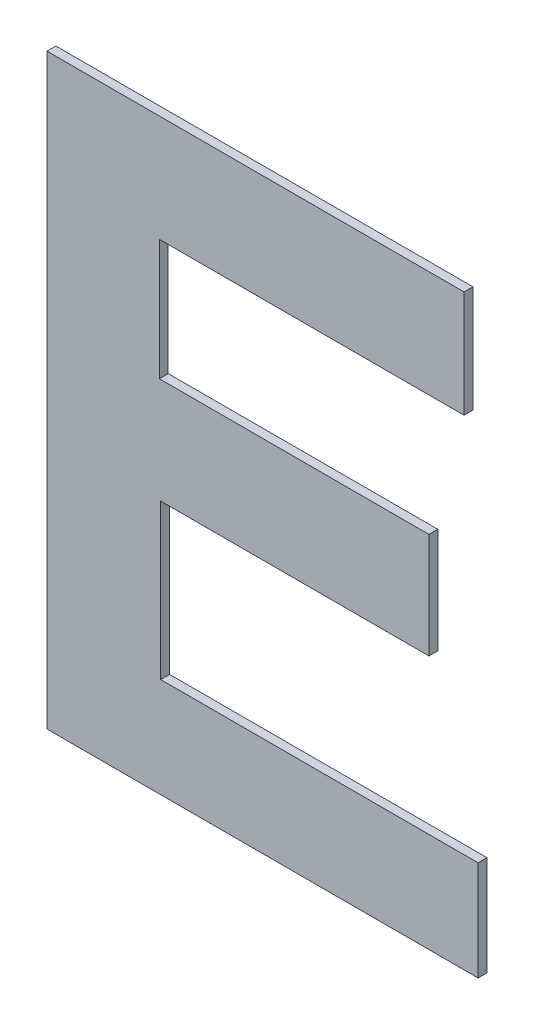
ISO-10303-21;
HEADER;
FILE_DESCRIPTION(('STEP AP214'),'2;1');
FILE_NAME('part.step','',(''),(''),'','','');
FILE_SCHEMA(('AUTOMOTIVE_DESIGN { 1 0 10303 214 1 1 1 1 }'));
ENDSEC;
DATA;
#1=APPLICATION_CONTEXT('core data for automotive mechanical design processes');
#2=APPLICATION_PROTOCOL_DEFINITION('international standard','automotive_design',2000,#1);
#3=PRODUCT_CONTEXT('',#1,'mechanical');
#4=PRODUCT('Part','Part','',(#3));
#5=PRODUCT_RELATED_PRODUCT_CATEGORY('part','',(#4));
#6=PRODUCT_DEFINITION_FORMATION('','',#4);
#7=PRODUCT_DEFINITION_CONTEXT('part definition',#1,'design');
#8=PRODUCT_DEFINITION('design','',#6,#7);
#9=PRODUCT_DEFINITION_SHAPE('','',#8);
#10=(LENGTH_UNIT() NAMED_UNIT(*) SI_UNIT(.MILLI.,.METRE.));
#11=(NAMED_UNIT(*) PLANE_ANGLE_UNIT() SI_UNIT($,.RADIAN.));
#12=(NAMED_UNIT(*) SI_UNIT($,.STERADIAN.) SOLID_ANGLE_UNIT());
#13=UNCERTAINTY_MEASURE_WITH_UNIT(LENGTH_MEASURE(1.E-05),#10,'distance_accuracy_value','');
#14=(GEOMETRIC_REPRESENTATION_CONTEXT(3) GLOBAL_UNCERTAINTY_ASSIGNED_CONTEXT((#13)) GLOBAL_UNIT_ASSIGNED_CONTEXT((#10,
#11,#12)) REPRESENTATION_CONTEXT('',''));
#15=CARTESIAN_POINT('',(0.,0.,0.));
#16=DIRECTION('',(0.,0.,1.));
#17=DIRECTION('',(1.,0.,0.));
#18=AXIS2_PLACEMENT_3D('',#15,#16,#17);
#19=CARTESIAN_POINT('',(3.7661104620931,-0.758479128131942,0.));
#20=DIRECTION('',(1.,0.,0.));
#21=DIRECTION('',(0.,1.,0.));
#22=AXIS2_PLACEMENT_3D('',#19,#20,#21);
#23=PLANE('',#22);
#24=DIRECTION('',(0.,1.,0.));
#25=VECTOR('',#24,1.);
#26=CARTESIAN_POINT('',(3.7661104620931,-0.758479128131942,0.));
#27=LINE('',#26,#25);
#28=CARTESIAN_POINT('',(3.7661104620931,-0.758479128131942,0.));
#29=VERTEX_POINT('',#28);
#30=CARTESIAN_POINT('',(3.7661104620931,-0.722389912967327,0.));
#31=VERTEX_POINT('',#30);
#32=EDGE_CURVE('E11',#29,#31,#27,.T.);
#33=ORIENTED_EDGE('',*,*,#32,.T.);
#34=DIRECTION('',(0.,0.,1.));
#35=VECTOR('',#34,1.);
#36=CARTESIAN_POINT('',(3.7661104620931,-0.722389912967327,0.));
#37=LINE('',#36,#35);
#38=CARTESIAN_POINT('',(3.7661104620931,-0.722389912967327,0.003));
#39=VERTEX_POINT('',#38);
#40=EDGE_CURVE('E24',#31,#39,#37,.T.);
#41=ORIENTED_EDGE('',*,*,#40,.T.);
#42=DIRECTION('',(0.,1.,0.));
#43=VECTOR('',#42,1.);
#44=CARTESIAN_POINT('',(3.7661104620931,-0.758479128131942,0.003));
#45=LINE('',#44,#43);
#46=CARTESIAN_POINT('',(3.7661104620931,-0.758479128131942,0.003));
#47=VERTEX_POINT('',#46);
#48=EDGE_CURVE('E124',#47,#39,#45,.T.);
#49=ORIENTED_EDGE('',*,*,#48,.F.);
#50=DIRECTION('',(0.,0.,1.));
#51=VECTOR('',#50,1.);
#52=CARTESIAN_POINT('',(3.7661104620931,-0.758479128131942,0.));
#53=LINE('',#52,#51);
#54=EDGE_CURVE('E206',#29,#47,#53,.T.);
#55=ORIENTED_EDGE('',*,*,#54,.F.);
#56=EDGE_LOOP('',(#33,#41,#49,#55));
#57=FACE_BOUND('',#56,.T.);
#58=ADVANCED_FACE('F17',(#57),#23,.T.);
#59=CARTESIAN_POINT('',(3.6631608084609,-0.758479128131942,0.));
#60=DIRECTION('',(0.,-1.,0.));
#61=DIRECTION('',(1.,0.,0.));
#62=AXIS2_PLACEMENT_3D('',#59,#60,#61);
#63=PLANE('',#62);
#64=DIRECTION('',(1.,0.,0.));
#65=VECTOR('',#64,1.);
#66=CARTESIAN_POINT('',(3.6631608084609,-0.758479128131942,0.));
#67=LINE('',#66,#65);
#68=CARTESIAN_POINT('',(3.6631608084609,-0.758479128131942,0.));
#69=VERTEX_POINT('',#68);
#70=EDGE_CURVE('E203',#69,#29,#67,.T.);
#71=ORIENTED_EDGE('',*,*,#70,.T.);
#72=ORIENTED_EDGE('',*,*,#54,.T.);
#73=DIRECTION('',(1.,0.,0.));
#74=VECTOR('',#73,1.);
#75=CARTESIAN_POINT('',(3.6631608084609,-0.758479128131942,0.003));
#76=LINE('',#75,#74);
#77=CARTESIAN_POINT('',(3.6631608084609,-0.758479128131942,0.003));
#78=VERTEX_POINT('',#77);
#79=EDGE_CURVE('E201',#78,#47,#76,.T.);
#80=ORIENTED_EDGE('',*,*,#79,.F.);
#81=DIRECTION('',(0.,0.,1.));
#82=VECTOR('',#81,1.);
#83=CARTESIAN_POINT('',(3.6631608084609,-0.758479128131942,0.));
#84=LINE('',#83,#82);
#85=EDGE_CURVE('E198',#69,#78,#84,.T.);
#86=ORIENTED_EDGE('',*,*,#85,.F.);
#87=EDGE_LOOP('',(#71,#72,#80,#86));
#88=FACE_BOUND('',#87,.T.);
#89=ADVANCED_FACE('F235',(#88),#63,.T.);
#90=CARTESIAN_POINT('',(3.6631608084609,-0.799266818471311,0.));
#91=DIRECTION('',(1.,0.,0.));
#92=DIRECTION('',(0.,1.,0.));
#93=AXIS2_PLACEMENT_3D('',#90,#91,#92);
#94=PLANE('',#93);
#95=DIRECTION('',(0.,1.,0.));
#96=VECTOR('',#95,1.);
#97=CARTESIAN_POINT('',(3.6631608084609,-0.799266818471311,0.));
#98=LINE('',#97,#96);
#99=CARTESIAN_POINT('',(3.6631608084609,-0.799266818471311,0.));
#100=VERTEX_POINT('',#99);
#101=EDGE_CURVE('E195',#100,#69,#98,.T.);
#102=ORIENTED_EDGE('',*,*,#101,.T.);
#103=ORIENTED_EDGE('',*,*,#85,.T.);
#104=DIRECTION('',(0.,1.,0.));
#105=VECTOR('',#104,1.);
#106=CARTESIAN_POINT('',(3.6631608084609,-0.799266818471311,0.003));
#107=LINE('',#106,#105);
#108=CARTESIAN_POINT('',(3.6631608084609,-0.799266818471311,0.003));
#109=VERTEX_POINT('',#108);
#110=EDGE_CURVE('E192',#109,#78,#107,.T.);
#111=ORIENTED_EDGE('',*,*,#110,.F.);
#112=DIRECTION('',(0.,0.,1.));
#113=VECTOR('',#112,1.);
#114=CARTESIAN_POINT('',(3.6631608084609,-0.799266818471311,0.));
#115=LINE('',#114,#113);
#116=EDGE_CURVE('E189',#100,#109,#115,.T.);
#117=ORIENTED_EDGE('',*,*,#116,.F.);
#118=EDGE_LOOP('',(#102,#103,#111,#117));
#119=FACE_BOUND('',#118,.T.);
#120=ADVANCED_FACE('F232',(#119),#94,.T.);
#121=CARTESIAN_POINT('',(3.7542506013696,-0.799266818471311,0.));
#122=DIRECTION('',(0.,1.,0.));
#123=DIRECTION('',(-1.,0.,0.));
#124=AXIS2_PLACEMENT_3D('',#121,#122,#123);
#125=PLANE('',#124);
#126=DIRECTION('',(-1.,0.,0.));
#127=VECTOR('',#126,1.);
#128=CARTESIAN_POINT('',(3.7542506013696,-0.799266818471311,0.));
#129=LINE('',#128,#127);
#130=CARTESIAN_POINT('',(3.7542506013696,-0.799266818471311,0.));
#131=VERTEX_POINT('',#130);
#132=EDGE_CURVE('E186',#131,#100,#129,.T.);
#133=ORIENTED_EDGE('',*,*,#132,.T.);
#134=ORIENTED_EDGE('',*,*,#116,.T.);
#135=DIRECTION('',(-1.,0.,0.));
#136=VECTOR('',#135,1.);
#137=CARTESIAN_POINT('',(3.7542506013696,-0.799266818471311,0.003));
#138=LINE('',#137,#136);
#139=CARTESIAN_POINT('',(3.7542506013696,-0.799266818471311,0.003));
#140=VERTEX_POINT('',#139);
#141=EDGE_CURVE('E183',#140,#109,#138,.T.);
#142=ORIENTED_EDGE('',*,*,#141,.F.);
#143=DIRECTION('',(0.,0.,1.));
#144=VECTOR('',#143,1.);
#145=CARTESIAN_POINT('',(3.7542506013696,-0.799266818471311,0.));
#146=LINE('',#145,#144);
#147=EDGE_CURVE('E180',#131,#140,#146,.T.);
#148=ORIENTED_EDGE('',*,*,#147,.F.);
#149=EDGE_LOOP('',(#133,#134,#142,#148));
#150=FACE_BOUND('',#149,.T.);
#151=ADVANCED_FACE('F229',(#150),#125,.T.);
#152=CARTESIAN_POINT('',(3.7542506013696,-0.834853031555771,0.));
#153=DIRECTION('',(1.,0.,0.));
#154=DIRECTION('',(0.,1.,0.));
#155=AXIS2_PLACEMENT_3D('',#152,#153,#154);
#156=PLANE('',#155);
#157=DIRECTION('',(0.,1.,0.));
#158=VECTOR('',#157,1.);
#159=CARTESIAN_POINT('',(3.7542506013696,-0.834853031555771,0.));
#160=LINE('',#159,#158);
#161=CARTESIAN_POINT('',(3.7542506013696,-0.834853031555771,0.));
#162=VERTEX_POINT('',#161);
#163=EDGE_CURVE('E177',#162,#131,#160,.T.);
#164=ORIENTED_EDGE('',*,*,#163,.T.);
#165=ORIENTED_EDGE('',*,*,#147,.T.);
#166=DIRECTION('',(0.,1.,0.));
#167=VECTOR('',#166,1.);
#168=CARTESIAN_POINT('',(3.7542506013696,-0.834853031555771,0.003));
#169=LINE('',#168,#167);
#170=CARTESIAN_POINT('',(3.7542506013696,-0.834853031555771,0.003));
#171=VERTEX_POINT('',#170);
#172=EDGE_CURVE('E174',#171,#140,#169,.T.);
#173=ORIENTED_EDGE('',*,*,#172,.F.);
#174=DIRECTION('',(0.,0.,1.));
#175=VECTOR('',#174,1.);
#176=CARTESIAN_POINT('',(3.7542506013696,-0.834853031555771,0.));
#177=LINE('',#176,#175);
#178=EDGE_CURVE('E171',#162,#171,#177,.T.);
#179=ORIENTED_EDGE('',*,*,#178,.F.);
#180=EDGE_LOOP('',(#164,#165,#173,#179));
#181=FACE_BOUND('',#180,.T.);
#182=ADVANCED_FACE('F226',(#181),#156,.T.);
#183=CARTESIAN_POINT('',(3.6636154996069,-0.834853031555771,0.));
#184=DIRECTION('',(0.,-1.,0.));
#185=DIRECTION('',(1.,0.,0.));
#186=AXIS2_PLACEMENT_3D('',#183,#184,#185);
#187=PLANE('',#186);
#188=DIRECTION('',(1.,0.,0.));
#189=VECTOR('',#188,1.);
#190=CARTESIAN_POINT('',(3.6636154996069,-0.834853031555771,0.));
#191=LINE('',#190,#189);
#192=CARTESIAN_POINT('',(3.6636154996069,-0.834853031555771,0.));
#193=VERTEX_POINT('',#192);
#194=EDGE_CURVE('E168',#193,#162,#191,.T.);
#195=ORIENTED_EDGE('',*,*,#194,.T.);
#196=ORIENTED_EDGE('',*,*,#178,.T.);
#197=DIRECTION('',(1.,0.,0.));
#198=VECTOR('',#197,1.);
#199=CARTESIAN_POINT('',(3.6636154996069,-0.834853031555771,0.003));
#200=LINE('',#199,#198);
#201=CARTESIAN_POINT('',(3.6636154996069,-0.834853031555771,0.003));
#202=VERTEX_POINT('',#201);
#203=EDGE_CURVE('E165',#202,#171,#200,.T.);
#204=ORIENTED_EDGE('',*,*,#203,.F.);
#205=DIRECTION('',(0.,0.,1.));
#206=VECTOR('',#205,1.);
#207=CARTESIAN_POINT('',(3.6636154996069,-0.834853031555771,0.));
#208=LINE('',#207,#206);
#209=EDGE_CURVE('E162',#193,#202,#208,.T.);
#210=ORIENTED_EDGE('',*,*,#209,.F.);
#211=EDGE_LOOP('',(#195,#196,#204,#210));
#212=FACE_BOUND('',#211,.T.);
#213=ADVANCED_FACE('F223',(#212),#187,.T.);
#214=CARTESIAN_POINT('',(3.6636154996069,-0.887060100571832,0.));
#215=DIRECTION('',(1.,0.,0.));
#216=DIRECTION('',(0.,1.,0.));
#217=AXIS2_PLACEMENT_3D('',#214,#215,#216);
#218=PLANE('',#217);
#219=DIRECTION('',(0.,1.,0.));
#220=VECTOR('',#219,1.);
#221=CARTESIAN_POINT('',(3.6636154996069,-0.887060100571832,0.));
#222=LINE('',#221,#220);
#223=CARTESIAN_POINT('',(3.6636154996069,-0.887060100571832,0.));
#224=VERTEX_POINT('',#223);
#225=EDGE_CURVE('E159',#224,#193,#222,.T.);
#226=ORIENTED_EDGE('',*,*,#225,.T.);
#227=ORIENTED_EDGE('',*,*,#209,.T.);
#228=DIRECTION('',(0.,1.,0.));
#229=VECTOR('',#228,1.);
#230=CARTESIAN_POINT('',(3.6636154996069,-0.887060100571832,0.003));
#231=LINE('',#230,#229);
#232=CARTESIAN_POINT('',(3.6636154996069,-0.887060100571832,0.003));
#233=VERTEX_POINT('',#232);
#234=EDGE_CURVE('E156',#233,#202,#231,.T.);
#235=ORIENTED_EDGE('',*,*,#234,.F.);
#236=DIRECTION('',(0.,0.,1.));
#237=VECTOR('',#236,1.);
#238=CARTESIAN_POINT('',(3.6636154996069,-0.887060100571832,0.));
#239=LINE('',#238,#237);
#240=EDGE_CURVE('E153',#224,#233,#239,.T.);
#241=ORIENTED_EDGE('',*,*,#240,.F.);
#242=EDGE_LOOP('',(#226,#227,#235,#241));
#243=FACE_BOUND('',#242,.T.);
#244=ADVANCED_FACE('F220',(#243),#218,.T.);
#245=CARTESIAN_POINT('',(3.7708752463937,-0.887060100571832,0.));
#246=DIRECTION('',(0.,1.,0.));
#247=DIRECTION('',(-1.,0.,0.));
#248=AXIS2_PLACEMENT_3D('',#245,#246,#247);
#249=PLANE('',#248);
#250=DIRECTION('',(-1.,0.,0.));
#251=VECTOR('',#250,1.);
#252=CARTESIAN_POINT('',(3.7708752463937,-0.887060100571832,0.));
#253=LINE('',#252,#251);
#254=CARTESIAN_POINT('',(3.7708752463937,-0.887060100571832,0.));
#255=VERTEX_POINT('',#254);
#256=EDGE_CURVE('E150',#255,#224,#253,.T.);
#257=ORIENTED_EDGE('',*,*,#256,.T.);
#258=ORIENTED_EDGE('',*,*,#240,.T.);
#259=DIRECTION('',(-1.,0.,0.));
#260=VECTOR('',#259,1.);
#261=CARTESIAN_POINT('',(3.7708752463937,-0.887060100571832,0.003));
#262=LINE('',#261,#260);
#263=CARTESIAN_POINT('',(3.7708752463937,-0.887060100571832,0.003));
#264=VERTEX_POINT('',#263);
#265=EDGE_CURVE('E147',#264,#233,#262,.T.);
#266=ORIENTED_EDGE('',*,*,#265,.F.);
#267=DIRECTION('',(0.,0.,1.));
#268=VECTOR('',#267,1.);
#269=CARTESIAN_POINT('',(3.7708752463937,-0.887060100571832,0.));
#270=LINE('',#269,#268);
#271=EDGE_CURVE('E144',#255,#264,#270,.T.);
#272=ORIENTED_EDGE('',*,*,#271,.F.);
#273=EDGE_LOOP('',(#257,#258,#266,#272));
#274=FACE_BOUND('',#273,.T.);
#275=ADVANCED_FACE('F217',(#274),#249,.T.);
#276=CARTESIAN_POINT('',(3.7708752463937,-0.920762187220293,0.));
#277=DIRECTION('',(1.,0.,0.));
#278=DIRECTION('',(0.,1.,0.));
#279=AXIS2_PLACEMENT_3D('',#276,#277,#278);
#280=PLANE('',#279);
#281=DIRECTION('',(0.,1.,0.));
#282=VECTOR('',#281,1.);
#283=CARTESIAN_POINT('',(3.7708752463937,-0.920762187220293,0.));
#284=LINE('',#283,#282);
#285=CARTESIAN_POINT('',(3.7708752463937,-0.920762187220293,0.));
#286=VERTEX_POINT('',#285);
#287=EDGE_CURVE('E141',#286,#255,#284,.T.);
#288=ORIENTED_EDGE('',*,*,#287,.T.);
#289=ORIENTED_EDGE('',*,*,#271,.T.);
#290=DIRECTION('',(0.,1.,0.));
#291=VECTOR('',#290,1.);
#292=CARTESIAN_POINT('',(3.7708752463937,-0.920762187220293,0.003));
#293=LINE('',#292,#291);
#294=CARTESIAN_POINT('',(3.7708752463937,-0.920762187220293,0.003));
#295=VERTEX_POINT('',#294);
#296=EDGE_CURVE('E138',#295,#264,#293,.T.);
#297=ORIENTED_EDGE('',*,*,#296,.F.);
#298=DIRECTION('',(0.,0.,1.));
#299=VECTOR('',#298,1.);
#300=CARTESIAN_POINT('',(3.7708752463937,-0.920762187220293,0.));
#301=LINE('',#300,#299);
#302=EDGE_CURVE('E135',#286,#295,#301,.T.);
#303=ORIENTED_EDGE('',*,*,#302,.F.);
#304=EDGE_LOOP('',(#288,#289,#297,#303));
#305=FACE_BOUND('',#304,.T.);
#306=ADVANCED_FACE('F214',(#305),#280,.T.);
#307=CARTESIAN_POINT('',(3.6251940977727,-0.920762187220293,0.));
#308=DIRECTION('',(0.,-1.,0.));
#309=DIRECTION('',(1.,0.,0.));
#310=AXIS2_PLACEMENT_3D('',#307,#308,#309);
#311=PLANE('',#310);
#312=DIRECTION('',(1.,0.,0.));
#313=VECTOR('',#312,1.);
#314=CARTESIAN_POINT('',(3.6251940977727,-0.920762187220293,0.));
#315=LINE('',#314,#313);
#316=CARTESIAN_POINT('',(3.6251940977727,-0.920762187220293,0.));
#317=VERTEX_POINT('',#316);
#318=EDGE_CURVE('E132',#317,#286,#315,.T.);
#319=ORIENTED_EDGE('',*,*,#318,.T.);
#320=ORIENTED_EDGE('',*,*,#302,.T.);
#321=DIRECTION('',(1.,0.,0.));
#322=VECTOR('',#321,1.);
#323=CARTESIAN_POINT('',(3.6251940977727,-0.920762187220293,0.003));
#324=LINE('',#323,#322);
#325=CARTESIAN_POINT('',(3.6251940977727,-0.920762187220293,0.003));
#326=VERTEX_POINT('',#325);
#327=EDGE_CURVE('E130',#326,#295,#324,.T.);
#328=ORIENTED_EDGE('',*,*,#327,.F.);
#329=DIRECTION('',(0.,0.,1.));
#330=VECTOR('',#329,1.);
#331=CARTESIAN_POINT('',(3.6251940977727,-0.920762187220293,0.));
#332=LINE('',#331,#330);
#333=EDGE_CURVE('E109',#317,#326,#332,.T.);
#334=ORIENTED_EDGE('',*,*,#333,.F.);
#335=EDGE_LOOP('',(#319,#320,#328,#334));
#336=FACE_BOUND('',#335,.T.);
#337=ADVANCED_FACE('F212',(#336),#311,.T.);
#338=CARTESIAN_POINT('',(3.6251940977727,-0.722389912967327,0.));
#339=DIRECTION('',(-1.,0.,0.));
#340=DIRECTION('',(0.,-1.,0.));
#341=AXIS2_PLACEMENT_3D('',#338,#339,#340);
#342=PLANE('',#341);
#343=DIRECTION('',(0.,-1.,0.));
#344=VECTOR('',#343,1.);
#345=CARTESIAN_POINT('',(3.6251940977727,-0.722389912967327,0.));
#346=LINE('',#345,#344);
#347=CARTESIAN_POINT('',(3.6251940977727,-0.722389912967327,0.));
#348=VERTEX_POINT('',#347);
#349=EDGE_CURVE('E113',#348,#317,#346,.T.);
#350=ORIENTED_EDGE('',*,*,#349,.T.);
#351=ORIENTED_EDGE('',*,*,#333,.T.);
#352=DIRECTION('',(0.,-1.,0.));
#353=VECTOR('',#352,1.);
#354=CARTESIAN_POINT('',(3.6251940977727,-0.722389912967327,0.003));
#355=LINE('',#354,#353);
#356=CARTESIAN_POINT('',(3.6251940977727,-0.722389912967327,0.003));
#357=VERTEX_POINT('',#356);
#358=EDGE_CURVE('E102',#357,#326,#355,.T.);
#359=ORIENTED_EDGE('',*,*,#358,.F.);
#360=DIRECTION('',(0.,0.,1.));
#361=VECTOR('',#360,1.);
#362=CARTESIAN_POINT('',(3.6251940977727,-0.722389912967327,0.));
#363=LINE('',#362,#361);
#364=EDGE_CURVE('E106',#348,#357,#363,.T.);
#365=ORIENTED_EDGE('',*,*,#364,.F.);
#366=EDGE_LOOP('',(#350,#351,#359,#365));
#367=FACE_BOUND('',#366,.T.);
#368=ADVANCED_FACE('F105',(#367),#342,.T.);
#369=CARTESIAN_POINT('',(3.7661104620931,-0.722389912967327,0.));
#370=DIRECTION('',(0.,1.,0.));
#371=DIRECTION('',(-1.,0.,0.));
#372=AXIS2_PLACEMENT_3D('',#369,#370,#371);
#373=PLANE('',#372);
#374=DIRECTION('',(-1.,0.,0.));
#375=VECTOR('',#374,1.);
#376=CARTESIAN_POINT('',(3.7661104620931,-0.722389912967327,0.));
#377=LINE('',#376,#375);
#378=EDGE_CURVE('E119',#31,#348,#377,.T.);
#379=ORIENTED_EDGE('',*,*,#378,.T.);
#380=ORIENTED_EDGE('',*,*,#364,.T.);
#381=DIRECTION('',(-1.,0.,0.));
#382=VECTOR('',#381,1.);
#383=CARTESIAN_POINT('',(3.7661104620931,-0.722389912967327,0.003));
#384=LINE('',#383,#382);
#385=EDGE_CURVE('E118',#39,#357,#384,.T.);
#386=ORIENTED_EDGE('',*,*,#385,.F.);
#387=ORIENTED_EDGE('',*,*,#40,.F.);
#388=EDGE_LOOP('',(#379,#380,#386,#387));
#389=FACE_BOUND('',#388,.T.);
#390=ADVANCED_FACE('F117',(#389),#373,.T.);
#391=CARTESIAN_POINT('',(3.6980346720832,-0.82157605009381,0.003));
#392=DIRECTION('',(0.,0.,1.));
#393=DIRECTION('',(1.,0.,0.));
#394=AXIS2_PLACEMENT_3D('',#391,#392,#393);
#395=PLANE('',#394);
#396=ORIENTED_EDGE('',*,*,#385,.T.);
#397=ORIENTED_EDGE('',*,*,#358,.T.);
#398=ORIENTED_EDGE('',*,*,#327,.T.);
#399=ORIENTED_EDGE('',*,*,#296,.T.);
#400=ORIENTED_EDGE('',*,*,#265,.T.);
#401=ORIENTED_EDGE('',*,*,#234,.T.);
#402=ORIENTED_EDGE('',*,*,#203,.T.);
#403=ORIENTED_EDGE('',*,*,#172,.T.);
#404=ORIENTED_EDGE('',*,*,#141,.T.);
#405=ORIENTED_EDGE('',*,*,#110,.T.);
#406=ORIENTED_EDGE('',*,*,#79,.T.);
#407=ORIENTED_EDGE('',*,*,#48,.T.);
#408=EDGE_LOOP('',(#396,#397,#398,#399,#400,#401,#402,#403,#404,#405,#406,#407));
#409=FACE_BOUND('',#408,.T.);
#410=ADVANCED_FACE('F122',(#409),#395,.T.);
#411=CARTESIAN_POINT('',(3.6980346720832,-0.82157605009381,0.));
#412=DIRECTION('',(0.,0.,1.));
#413=DIRECTION('',(1.,0.,0.));
#414=AXIS2_PLACEMENT_3D('',#411,#412,#413);
#415=PLANE('',#414);
#416=ORIENTED_EDGE('',*,*,#378,.F.);
#417=ORIENTED_EDGE('',*,*,#32,.F.);
#418=ORIENTED_EDGE('',*,*,#70,.F.);
#419=ORIENTED_EDGE('',*,*,#101,.F.);
#420=ORIENTED_EDGE('',*,*,#132,.F.);
#421=ORIENTED_EDGE('',*,*,#163,.F.);
#422=ORIENTED_EDGE('',*,*,#194,.F.);
#423=ORIENTED_EDGE('',*,*,#225,.F.);
#424=ORIENTED_EDGE('',*,*,#256,.F.);
#425=ORIENTED_EDGE('',*,*,#287,.F.);
#426=ORIENTED_EDGE('',*,*,#318,.F.);
#427=ORIENTED_EDGE('',*,*,#349,.F.);
#428=EDGE_LOOP('',(#416,#417,#418,#419,#420,#421,#422,#423,#424,#425,#426,#427));
#429=FACE_BOUND('',#428,.T.);
#430=ADVANCED_FACE('F209',(#429),#415,.F.);
#431=CLOSED_SHELL('',(#58,#89,#120,#151,#182,#213,#244,#275,#306,#337,#368,#390,#410,#430));
#432=MANIFOLD_SOLID_BREP('B1',#431);
#433=ADVANCED_BREP_SHAPE_REPRESENTATION('',(#18,#432),#14);
#434=SHAPE_DEFINITION_REPRESENTATION(#9,#433);
ENDSEC;
END-ISO-10303-21;
